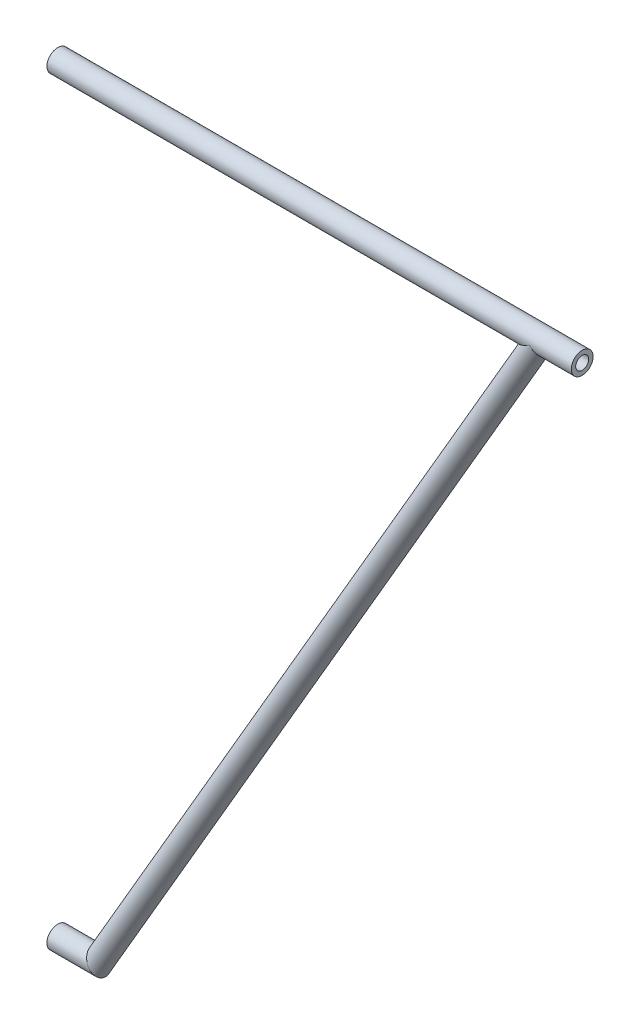
ISO-10303-21;
HEADER;
FILE_DESCRIPTION(('STEP AP214'),'2;1');
FILE_NAME('part.step','',(''),(''),'','','');
FILE_SCHEMA(('AUTOMOTIVE_DESIGN { 1 0 10303 214 1 1 1 1 }'));
ENDSEC;
DATA;
#1=APPLICATION_CONTEXT('core data for automotive mechanical design processes');
#2=APPLICATION_PROTOCOL_DEFINITION('international standard','automotive_design',2000,#1);
#3=PRODUCT_CONTEXT('',#1,'mechanical');
#4=PRODUCT('Part','Part','',(#3));
#5=PRODUCT_RELATED_PRODUCT_CATEGORY('part','',(#4));
#6=PRODUCT_DEFINITION_FORMATION('','',#4);
#7=PRODUCT_DEFINITION_CONTEXT('part definition',#1,'design');
#8=PRODUCT_DEFINITION('design','',#6,#7);
#9=PRODUCT_DEFINITION_SHAPE('','',#8);
#10=(LENGTH_UNIT() NAMED_UNIT(*) SI_UNIT(.MILLI.,.METRE.));
#11=(NAMED_UNIT(*) PLANE_ANGLE_UNIT() SI_UNIT($,.RADIAN.));
#12=(NAMED_UNIT(*) SI_UNIT($,.STERADIAN.) SOLID_ANGLE_UNIT());
#13=UNCERTAINTY_MEASURE_WITH_UNIT(LENGTH_MEASURE(1.E-05),#10,'distance_accuracy_value','');
#14=(GEOMETRIC_REPRESENTATION_CONTEXT(3) GLOBAL_UNCERTAINTY_ASSIGNED_CONTEXT((#13)) GLOBAL_UNIT_ASSIGNED_CONTEXT((#10,
#11,#12)) REPRESENTATION_CONTEXT('',''));
#15=CARTESIAN_POINT('',(0.,0.,0.));
#16=DIRECTION('',(0.,0.,1.));
#17=DIRECTION('',(1.,0.,0.));
#18=AXIS2_PLACEMENT_3D('',#15,#16,#17);
#19=CARTESIAN_POINT('',(-502.784300344481,-1414.57190836725,0.));
#20=DIRECTION('',(0.502784300344481,0.86441190836725,0.));
#21=DIRECTION('',(-0.86441190836725,0.502784300344481,0.));
#22=AXIS2_PLACEMENT_3D('',#19,#20,#21);
#23=CYLINDRICAL_SURFACE('',#22,7.89999999999998);
#24=CARTESIAN_POINT('',(327.345807114745,0.,4.7));
#25=CARTESIAN_POINT('',(327.285238653665,-0.10413362850605,4.69999976951445));
#26=CARTESIAN_POINT('',(327.22687811465,-0.209573285243799,4.69653902828784));
#27=CARTESIAN_POINT('',(327.115220690938,-0.422607114112524,4.6821787915491));
#28=CARTESIAN_POINT('',(327.061923464368,-0.530201140186111,4.67127979867354));
#29=CARTESIAN_POINT('',(326.960908461362,-0.74702302383423,4.64154460837723));
#30=CARTESIAN_POINT('',(326.913195071602,-0.856252090926869,4.62270222338164));
#31=CARTESIAN_POINT('',(326.823856307019,-1.07539005260659,4.57668681265745));
#32=CARTESIAN_POINT('',(326.782227947919,-1.1852985862098,4.54951789088959));
#33=CARTESIAN_POINT('',(326.705095489311,-1.4053880351159,4.48642938079778));
#34=CARTESIAN_POINT('',(326.669621271144,-1.5155677819011,4.45046903280596));
#35=CARTESIAN_POINT('',(326.605050912032,-1.73457877759029,4.36976607416312));
#36=CARTESIAN_POINT('',(326.575955001464,-1.84340997765274,4.32502314640809));
#37=CARTESIAN_POINT('',(326.523906224731,-2.05859375961628,4.22684020810985));
#38=CARTESIAN_POINT('',(326.500953658488,-2.16494622027243,4.17339977315359));
#39=CARTESIAN_POINT('',(326.460737567785,-2.37408152119991,4.05807805055075));
#40=CARTESIAN_POINT('',(326.443473935926,-2.47686442882702,3.99619692228472));
#41=CARTESIAN_POINT('',(326.414854837532,-2.67213216538377,3.86814548257));
#42=CARTESIAN_POINT('',(326.403218026436,-2.76486979913981,3.80242263469956));
#43=CARTESIAN_POINT('',(326.383839770197,-2.94560165394945,3.66420416694769));
#44=CARTESIAN_POINT('',(326.376099659844,-3.03359424041392,3.59170623637296));
#45=CARTESIAN_POINT('',(326.35777215524,-3.28945388700425,3.36472687832804));
#46=CARTESIAN_POINT('',(326.352061502246,-3.44932516235784,3.2006797075376));
#47=CARTESIAN_POINT('',(326.348526590962,-3.75486332749254,2.83753030463128));
#48=CARTESIAN_POINT('',(326.351344582087,-3.89848355775103,2.63670019952504));
#49=CARTESIAN_POINT('',(326.358546755256,-4.08895300396531,2.32070250619039));
#50=CARTESIAN_POINT('',(326.361445933165,-4.14831029698243,2.21284321713339));
#51=CARTESIAN_POINT('',(326.367708734194,-4.25837636626431,1.99282193333962));
#52=CARTESIAN_POINT('',(326.371072220233,-4.30908768532305,1.88066121558784));
#53=CARTESIAN_POINT('',(326.378018740262,-4.40462844720377,1.64513212168538));
#54=CARTESIAN_POINT('',(326.381601508272,-4.44884294493837,1.5215143046056));
#55=CARTESIAN_POINT('',(326.388307913216,-4.52678306386795,1.27100028801385));
#56=CARTESIAN_POINT('',(326.391431542757,-4.56050851616869,1.14410403574826));
#57=CARTESIAN_POINT('',(326.39687477889,-4.6172320215262,0.887909404895051));
#58=CARTESIAN_POINT('',(326.399194330752,-4.64022934439821,0.758610863423909));
#59=CARTESIAN_POINT('',(326.402795156322,-4.67532726386262,0.498530766742787));
#60=CARTESIAN_POINT('',(326.404076447466,-4.68742804345031,0.367749236475301));
#61=CARTESIAN_POINT('',(326.405481699087,-4.70068006564592,0.10493100695073));
#62=CARTESIAN_POINT('',(326.405599494203,-4.70177297820447,-0.0271086715488298));
#63=CARTESIAN_POINT('',(326.40465062759,-4.69285100038206,-0.290759702374713));
#64=CARTESIAN_POINT('',(326.403584394417,-4.68284012898141,-0.422371192395148));
#65=CARTESIAN_POINT('',(326.400370115811,-4.65178538832378,-0.684320478320359));
#66=CARTESIAN_POINT('',(326.398221679788,-4.63073753546507,-0.814657797022265));
#67=CARTESIAN_POINT('',(326.393059994494,-4.57776999130954,-1.0730363337992));
#68=CARTESIAN_POINT('',(326.390047062585,-4.54585428885853,-1.20107837618903));
#69=CARTESIAN_POINT('',(326.38349202896,-4.47145442253888,-1.45375564398966));
#70=CARTESIAN_POINT('',(326.379951018685,-4.4289919391968,-1.57839728322401));
#71=CARTESIAN_POINT('',(326.372775939509,-4.33378130681912,-1.82363226414578));
#72=CARTESIAN_POINT('',(326.369141905397,-4.28103695543319,-1.94422708132511));
#73=CARTESIAN_POINT('',(326.362327376043,-4.16557865180082,-2.18065895238851));
#74=CARTESIAN_POINT('',(326.359147181816,-4.10285814050569,-2.29649281258089));
#75=CARTESIAN_POINT('',(326.353905718178,-3.96793132682003,-2.52246530893198));
#76=CARTESIAN_POINT('',(326.351844015463,-3.89572871127159,-2.63260613558463));
#77=CARTESIAN_POINT('',(326.349599352749,-3.74195436957181,-2.84697391686338));
#78=CARTESIAN_POINT('',(326.349425506617,-3.6603391141074,-2.95116976946934));
#79=CARTESIAN_POINT('',(326.35185665058,-3.48866473393479,-3.15225090956117));
#80=CARTESIAN_POINT('',(326.3544604228,-3.39860932568108,-3.24913938110496));
#81=CARTESIAN_POINT('',(326.363398056002,-3.21076249930477,-3.43488665722103));
#82=CARTESIAN_POINT('',(326.369731155657,-3.11297266365844,-3.52374709641207));
#83=CARTESIAN_POINT('',(326.38712092128,-2.91050812602607,-3.69273952637561));
#84=CARTESIAN_POINT('',(326.398177268312,-2.80583388931284,-3.77287210603832));
#85=CARTESIAN_POINT('',(326.425330790969,-2.59569980691065,-3.92020737121361));
#86=CARTESIAN_POINT('',(326.441166451922,-2.49050841132238,-3.98784090172771));
#87=CARTESIAN_POINT('',(326.478761761592,-2.27586731649474,-4.11411333299787));
#88=CARTESIAN_POINT('',(326.500521122752,-2.16641782417984,-4.17275267014877));
#89=CARTESIAN_POINT('',(326.550528114336,-1.94453870822814,-4.28065116497164));
#90=CARTESIAN_POINT('',(326.578770143103,-1.83211173119755,-4.32991835426571));
#91=CARTESIAN_POINT('',(326.642095969467,-1.60545288234261,-4.41897583461929));
#92=CARTESIAN_POINT('',(326.67717937275,-1.4912211148888,-4.4587666715702));
#93=CARTESIAN_POINT('',(326.750822124253,-1.27238932754458,-4.52580735324716));
#94=CARTESIAN_POINT('',(326.788795082312,-1.16783596074914,-4.55385767713221));
#95=CARTESIAN_POINT('',(326.870304329732,-0.95911906674372,-4.6023458114175));
#96=CARTESIAN_POINT('',(326.913842692437,-0.854955699786452,-4.62278077361646));
#97=CARTESIAN_POINT('',(327.052380084069,-0.544202498586157,-4.6730939423617));
#98=CARTESIAN_POINT('',(327.155334817728,-0.339250227044663,-4.69200991926504));
#99=CARTESIAN_POINT('',(327.344324907706,0.000526382533244408,-4.70207883516496));
#100=CARTESIAN_POINT('',(327.425991875369,0.137732065188808,-4.69992260692562));
#101=CARTESIAN_POINT('',(327.596139926183,0.407262435804782,-4.68426520974023));
#102=CARTESIAN_POINT('',(327.684623545685,0.539585279601888,-4.67075979927266));
#103=CARTESIAN_POINT('',(327.867169844283,0.799293615146722,-4.63340075123567));
#104=CARTESIAN_POINT('',(327.961246896142,0.926664861970003,-4.60951936384658));
#105=CARTESIAN_POINT('',(328.153447653544,1.17607384466345,-4.55227576220704));
#106=CARTESIAN_POINT('',(328.251571377682,1.29811155601988,-4.51891350438635));
#107=CARTESIAN_POINT('',(328.488859711038,1.58273462449444,-4.42888190808528));
#108=CARTESIAN_POINT('',(328.629348964984,1.74294760756097,-4.36817985657278));
#109=CARTESIAN_POINT('',(328.913190063648,2.05383099523372,-4.23091731963089));
#110=CARTESIAN_POINT('',(329.056543242698,2.20449680858384,-4.15434927866223));
#111=CARTESIAN_POINT('',(329.343621753431,2.49646516544909,-3.98573404520773));
#112=CARTESIAN_POINT('',(329.487347025201,2.63776912941422,-3.89368920850983));
#113=CARTESIAN_POINT('',(329.772762505614,2.91093775610667,-3.69392253049755));
#114=CARTESIAN_POINT('',(329.914453668499,3.04280696878808,-3.58620832287862));
#115=CARTESIAN_POINT('',(330.150859133933,3.25804569860989,-3.38960693915649));
#116=CARTESIAN_POINT('',(330.246766804358,3.34397790389021,-3.30494260096134));
#117=CARTESIAN_POINT('',(330.435313792785,3.51066642574493,-3.12730825805008));
#118=CARTESIAN_POINT('',(330.527953911371,3.59142401417176,-3.03434030780459));
#119=CARTESIAN_POINT('',(330.708618309027,3.74710651559006,-2.83983790904415));
#120=CARTESIAN_POINT('',(330.796650665829,3.82204175553489,-2.7383193257201));
#121=CARTESIAN_POINT('',(330.96677267741,3.96543576207824,-2.52620286686403));
#122=CARTESIAN_POINT('',(331.048864632756,4.03389703906234,-2.41560854192999));
#123=CARTESIAN_POINT('',(331.235527152156,4.18828694415504,-2.14051776511782));
#124=CARTESIAN_POINT('',(331.336605147753,4.27081121681039,-1.97164554724895));
#125=CARTESIAN_POINT('',(331.518009014326,4.41771290468907,-1.61576981204672));
#126=CARTESIAN_POINT('',(331.598363803511,4.48211561921144,-1.42879206710113));
#127=CARTESIAN_POINT('',(331.719126452987,4.57841694268126,-1.07483185126058));
#128=CARTESIAN_POINT('',(331.764161403617,4.61411363818006,-0.910488125784863));
#129=CARTESIAN_POINT('',(331.832098115103,4.66785016058079,-0.574486008227565));
#130=CARTESIAN_POINT('',(331.855019361196,4.68590553211215,-0.40283419511419));
#131=CARTESIAN_POINT('',(331.876551818397,4.70286914976343,-0.0564154279541589));
#132=CARTESIAN_POINT('',(331.875077227393,4.70170981620163,0.118360360406875));
#133=CARTESIAN_POINT('',(331.847760499268,4.68018385323926,0.464795883808734));
#134=CARTESIAN_POINT('',(331.82190893678,4.65980979445592,0.636454387381703));
#135=CARTESIAN_POINT('',(331.750054318458,4.60292965646036,0.964081063873849));
#136=CARTESIAN_POINT('',(331.705030151655,4.5672065385887,1.12040777261819));
#137=CARTESIAN_POINT('',(331.598382899072,4.48209174898499,1.4232511156704));
#138=CARTESIAN_POINT('',(331.536753016663,4.43269448026953,1.56976370238431));
#139=CARTESIAN_POINT('',(331.359739031156,4.28974020399538,1.93554657630225));
#140=CARTESIAN_POINT('',(331.234144512817,4.18736231056676,2.14647383146282));
#141=CARTESIAN_POINT('',(331.029358653828,4.01761372322883,2.441670655447));
#142=CARTESIAN_POINT('',(330.958223723316,3.95821424963641,2.53668665724759));
#143=CARTESIAN_POINT('',(330.811528420478,3.83459707091441,2.71993694851813));
#144=CARTESIAN_POINT('',(330.735969029551,3.77038043340924,2.8081727319585));
#145=CARTESIAN_POINT('',(330.541747878189,3.60360318914047,3.0217026431959));
#146=CARTESIAN_POINT('',(330.420853403479,3.49826708319141,3.14279623707265));
#147=CARTESIAN_POINT('',(330.173803761099,3.27892381579384,3.37101090792349));
#148=CARTESIAN_POINT('',(330.047645797082,3.16491201799454,3.47812442964781));
#149=CARTESIAN_POINT('',(329.791919575088,2.92859399655902,3.67933214559985));
#150=CARTESIAN_POINT('',(329.662342908455,2.80626586944215,3.77338980467209));
#151=CARTESIAN_POINT('',(329.402034213878,2.55390660442084,3.94856273675801));
#152=CARTESIAN_POINT('',(329.271302429143,2.42387705665077,4.02968066878799));
#153=CARTESIAN_POINT('',(329.005168170457,2.15067152936775,4.18211230766783));
#154=CARTESIAN_POINT('',(328.869790018835,2.00717682369002,4.25289851855651));
#155=CARTESIAN_POINT('',(328.601685231864,1.71149991931627,4.38026100070593));
#156=CARTESIAN_POINT('',(328.468959676666,1.55931427515142,4.43683158759726));
#157=CARTESIAN_POINT('',(328.209249901223,1.24685622780002,4.53453440939799));
#158=CARTESIAN_POINT('',(328.082237847916,1.08663352430934,4.57575078227566));
#159=CARTESIAN_POINT('',(327.835918109076,0.75725151950632,4.64162889154813));
#160=CARTESIAN_POINT('',(327.716601053702,0.588103560737033,4.66631111841002));
#161=CARTESIAN_POINT('',(327.558105897321,0.346881207525483,4.68767541987602));
#162=CARTESIAN_POINT('',(327.514377587912,0.278426095603166,4.69225535536163));
#163=CARTESIAN_POINT('',(327.428697762009,0.140180396743926,4.69841920053788));
#164=CARTESIAN_POINT('',(327.386748037402,0.0703885612188404,4.70000015579546));
#165=CARTESIAN_POINT('',(327.345807114745,0.,4.7));
#166=B_SPLINE_CURVE_WITH_KNOTS('',3,(#24,#25,#26,#27,#28,#29,#30,#31,#32,#33,#34,#35,#36,#37,
#38,#39,#40,#41,#42,#43,#44,#45,#46,#47,#48,#49,#50,#51,#52,#53,#54,#55,#56,#57,#58,#59,#60,#61,
#62,#63,#64,#65,#66,#67,#68,#69,#70,#71,#72,#73,#74,#75,#76,#77,#78,#79,#80,#81,#82,#83,#84,#85,
#86,#87,#88,#89,#90,#91,#92,#93,#94,#95,#96,#97,#98,#99,#100,#101,#102,#103,#104,#105,#106,#107,
#108,#109,#110,#111,#112,#113,#114,#115,#116,#117,#118,#119,#120,#121,#122,#123,#124,#125,#126,
#127,#128,#129,#130,#131,#132,#133,#134,#135,#136,#137,#138,#139,#140,#141,#142,#143,#144,#145,
#146,#147,#148,#149,#150,#151,#152,#153,#154,#155,#156,#157,#158,#159,#160,#161,#162,#163,#164,
#165),.UNSPECIFIED.,.T.,.F.,(4,2,2,2,2,2,2,2,2,2,2,2,2,2,2,2,2,2,2,2,2,2,2,2,2,2,2,2,2,2,2,2,2,
2,2,2,2,2,2,2,2,2,2,2,2,2,2,2,2,2,2,2,2,2,2,2,2,2,2,2,2,2,2,2,2,2,2,2,2,2,4),(0.,
0.361343942056019,0.722663468871959,1.08426497027574,1.44568853236527,1.80882064336565,
2.17196586803396,2.53512881844926,2.89828491242532,3.24067943177419,3.58319115654013,
4.26777815390921,5.00516726090629,5.37429744947756,5.74331888833057,6.13686687087746,
6.53042118999238,6.92400229154453,7.31757678321766,7.71323571302733,8.10875148202735,
8.50441010375319,8.8999236624515,9.29463081545377,9.68919245705355,10.084014592536,
10.4786836648652,10.8752572100843,11.2716569451399,11.6679757849418,12.0642678675468,
12.4419229953138,12.819559793598,13.1968714971389,13.5741614601353,13.9179061836666,
14.2617793415321,14.9492027979007,15.4276914469865,15.9063590008534,16.3863146742481,
16.8662725533603,17.5300591286976,18.1941625351485,18.8581649469939,19.5218449513956,
19.9838837728566,20.4458085921847,20.9068944608383,21.3678007963432,22.0059153936466,
22.6431346556333,23.163268164386,23.682942943746,24.2044458482624,24.7261504748316,
25.2239211081952,25.7218957866939,26.5150083745243,26.9129770932223,27.3108578695328,
27.9127810844067,28.5150282614091,29.118928164252,29.7227038099107,30.3508353603949,
30.9792176821702,31.6041040964964,32.2282146606482,32.4722228787274,32.7164713559135),.UNSPECIFIED.);
#167=CARTESIAN_POINT('',(327.345807114745,0.,4.7));
#168=VERTEX_POINT('',#167);
#169=EDGE_CURVE('E50',#168,#168,#166,.T.);
#170=ORIENTED_EDGE('',*,*,#169,.T.);
#171=EDGE_LOOP('',(#170));
#172=FACE_BOUND('',#171,.T.);
#173=ADVANCED_FACE('F39',(#172),#23,.T.);
#174=CARTESIAN_POINT('',(-502.784300344481,-1414.57190836725,0.));
#175=DIRECTION('',(0.502784300344481,0.86441190836725,0.));
#176=DIRECTION('',(-0.86441190836725,0.502784300344481,0.));
#177=AXIS2_PLACEMENT_3D('',#174,#175,#176);
#178=CYLINDRICAL_SURFACE('',#177,7.89999999999998);
#179=CARTESIAN_POINT('',(308.127088356517,-4.70000000000022,0.));
#180=CARTESIAN_POINT('',(308.127090064675,-4.69999878472702,0.0989611156167974));
#181=CARTESIAN_POINT('',(308.131071673241,-4.69686443081223,0.197969839318741));
#182=CARTESIAN_POINT('',(308.14687284125,-4.68441283159583,0.395020000757673));
#183=CARTESIAN_POINT('',(308.158699162925,-4.67509025196863,0.493060529836296));
#184=CARTESIAN_POINT('',(308.189857946613,-4.65048546529992,0.687463755996175));
#185=CARTESIAN_POINT('',(308.209211200251,-4.63518674987498,0.783821026241028));
#186=CARTESIAN_POINT('',(308.254847492438,-4.59902436466502,0.973832271124095));
#187=CARTESIAN_POINT('',(308.281134452168,-4.57815754590312,1.06748468274285));
#188=CARTESIAN_POINT('',(308.368667520336,-4.50846269683752,1.34121479531705));
#189=CARTESIAN_POINT('',(308.439016913775,-4.45220341669055,1.51657107319673));
#190=CARTESIAN_POINT('',(308.598421921588,-4.32357886608922,1.85175867452132));
#191=CARTESIAN_POINT('',(308.687474805981,-4.25121594604833,2.01159225870229));
#192=CARTESIAN_POINT('',(308.859939545387,-4.10949548107154,2.28488426102534));
#193=CARTESIAN_POINT('',(308.940852315444,-4.04248774799532,2.4011856956856));
#194=CARTESIAN_POINT('',(309.109485281998,-3.90139010908576,2.62423016797008));
#195=CARTESIAN_POINT('',(309.197209083651,-3.82729644771512,2.73096807823893));
#196=CARTESIAN_POINT('',(309.3780260343,-3.67274447321952,2.93554640034488));
#197=CARTESIAN_POINT('',(309.471134348672,-3.59226792016089,3.03335946038532));
#198=CARTESIAN_POINT('',(309.661108495244,-3.42579850149408,3.22017903411196));
#199=CARTESIAN_POINT('',(309.757974090436,-3.33980598360579,3.30918610201993));
#200=CARTESIAN_POINT('',(309.995033161913,-3.12602750869938,3.51397987748186));
#201=CARTESIAN_POINT('',(310.136550008226,-2.99568740986427,3.62558264009068));
#202=CARTESIAN_POINT('',(310.422160304814,-2.72543496576536,3.83288628906537));
#203=CARTESIAN_POINT('',(310.566255015166,-2.58551783921238,3.92857914952385));
#204=CARTESIAN_POINT('',(310.854497791709,-2.29633333796681,4.10432375579022));
#205=CARTESIAN_POINT('',(310.998645829672,-2.14706873021156,4.18438010151391));
#206=CARTESIAN_POINT('',(311.284568537391,-1.83899093853012,4.3286292560458));
#207=CARTESIAN_POINT('',(311.426344306624,-1.68018234400841,4.39282961480296));
#208=CARTESIAN_POINT('',(311.664648803219,-1.39994065193017,4.48835024004018));
#209=CARTESIAN_POINT('',(311.762417539049,-1.28096267036062,4.52381133489818));
#210=CARTESIAN_POINT('',(311.954333426002,-1.03785857010876,4.58569293563082));
#211=CARTESIAN_POINT('',(312.048481514042,-0.913733800776683,4.61211579449569));
#212=CARTESIAN_POINT('',(312.231770202434,-0.660552438125307,4.65511803811332));
#213=CARTESIAN_POINT('',(312.320920485941,-0.531506257457223,4.67171709828596));
#214=CARTESIAN_POINT('',(312.493053778521,-0.268449670130713,4.69418224565891));
#215=CARTESIAN_POINT('',(312.576038472059,-0.13444063444815,4.7000512747685));
#216=CARTESIAN_POINT('',(312.716764407752,0.107634210986176,4.69995955644124));
#217=CARTESIAN_POINT('',(312.776010491079,0.214827832182839,4.69634318708091));
#218=CARTESIAN_POINT('',(312.889254407507,0.431419015787148,4.68141587442133));
#219=CARTESIAN_POINT('',(312.943253571151,0.54081601091177,4.6701068877069));
#220=CARTESIAN_POINT('',(313.045408485386,0.761138284943872,4.6392923955619));
#221=CARTESIAN_POINT('',(313.093566401293,0.872062980457509,4.61978993944275));
#222=CARTESIAN_POINT('',(313.183592785849,1.09456764466282,4.57218286251103));
#223=CARTESIAN_POINT('',(313.225464179868,1.2061472833085,4.54408226136725));
#224=CARTESIAN_POINT('',(313.302903185831,1.42956470832868,4.47883426500519));
#225=CARTESIAN_POINT('',(313.338436493702,1.54140076708906,4.44164007708693));
#226=CARTESIAN_POINT('',(313.402934072149,1.76358224609042,4.35819442607302));
#227=CARTESIAN_POINT('',(313.431898246255,1.87392764441832,4.31194282998569));
#228=CARTESIAN_POINT('',(313.483537066108,2.09198797312092,4.21046958182852));
#229=CARTESIAN_POINT('',(313.506209078723,2.19970178509075,4.15524418970388));
#230=CARTESIAN_POINT('',(313.545747355482,2.41132237133537,4.03612054572615));
#231=CARTESIAN_POINT('',(313.562613740438,2.51522922479067,3.97222247438537));
#232=CARTESIAN_POINT('',(313.59019342262,2.71099809879924,3.84101140387617));
#233=CARTESIAN_POINT('',(313.601259131656,2.80319109724101,3.77426485845722));
#234=CARTESIAN_POINT('',(313.619576561159,2.98273277783792,3.63404702231191));
#235=CARTESIAN_POINT('',(313.626827002491,3.07007982653732,3.56057348592784));
#236=CARTESIAN_POINT('',(313.643812387862,3.32384717947981,3.33077031052559));
#237=CARTESIAN_POINT('',(313.64879989124,3.48214081852818,3.16495952648943));
#238=CARTESIAN_POINT('',(313.651172604241,3.78451415607224,2.79793066264897));
#239=CARTESIAN_POINT('',(313.647919281043,3.92645104874832,2.59494285412697));
#240=CARTESIAN_POINT('',(313.640288661153,4.11407948147611,2.27588329569043));
#241=CARTESIAN_POINT('',(313.637284028924,4.17243712865346,2.16703016032428));
#242=CARTESIAN_POINT('',(313.630878405063,4.28040125317135,1.94508891661928));
#243=CARTESIAN_POINT('',(313.627477531783,4.33001033250527,1.83200207963705));
#244=CARTESIAN_POINT('',(313.620524276421,4.42306358999647,1.59491491036445));
#245=CARTESIAN_POINT('',(313.616976146282,4.4659091990946,1.4706795508755));
#246=CARTESIAN_POINT('',(313.610393630257,4.54105427477568,1.21904329364231));
#247=CARTESIAN_POINT('',(313.607359252061,4.57335358349369,1.09164234854391));
#248=CARTESIAN_POINT('',(313.602134967185,4.62717622344869,0.834558905670712));
#249=CARTESIAN_POINT('',(313.599945108458,4.64869894278929,0.704876278774325));
#250=CARTESIAN_POINT('',(313.596629364999,4.68080975123193,0.444152671336698));
#251=CARTESIAN_POINT('',(313.595503462179,4.69139802622533,0.313111713926052));
#252=CARTESIAN_POINT('',(313.59442101888,4.70158361813661,0.0500633312163522));
#253=CARTESIAN_POINT('',(313.594469259033,4.70113600131227,-0.0819458566984744));
#254=CARTESIAN_POINT('',(313.595742095373,4.68914466661991,-0.345405263157774));
#255=CARTESIAN_POINT('',(313.596966265438,4.67760496818585,-0.476855666858163));
#256=CARTESIAN_POINT('',(313.600472822755,4.6435142326696,-0.738354951048037));
#257=CARTESIAN_POINT('',(313.602755596773,4.62095917091041,-0.868403301506009));
#258=CARTESIAN_POINT('',(313.608146762893,4.56501053348041,-1.12607923594611));
#259=CARTESIAN_POINT('',(313.611254852483,4.53162092811717,-1.25370768859159));
#260=CARTESIAN_POINT('',(313.617947157523,4.4543011728361,-1.50549582665339));
#261=CARTESIAN_POINT('',(313.621530611002,4.41038780267358,-1.62966068629994));
#262=CARTESIAN_POINT('',(313.62872110102,4.31231827321399,-1.87382311071715));
#263=CARTESIAN_POINT('',(313.632328128359,4.2581659036289,-1.99382219795669));
#264=CARTESIAN_POINT('',(313.639003535618,4.13994179690266,-2.22894787131509));
#265=CARTESIAN_POINT('',(313.642071553406,4.07586344500685,-2.34407114252399));
#266=CARTESIAN_POINT('',(313.646988015,3.93828321451236,-2.56850998378759));
#267=CARTESIAN_POINT('',(313.648836934575,3.86478502552149,-2.67782780416384));
#268=CARTESIAN_POINT('',(313.650538977422,3.70852676945062,-2.89038095359925));
#269=CARTESIAN_POINT('',(313.650383462057,3.62572813865743,-2.99358802801296));
#270=CARTESIAN_POINT('',(313.647167852405,3.45178465353319,-3.19259113857089));
#271=CARTESIAN_POINT('',(313.644109043302,3.36064350826132,-3.28839043358039));
#272=CARTESIAN_POINT('',(313.63412853184,3.17074475239055,-3.47185862923065));
#273=CARTESIAN_POINT('',(313.627207823926,3.07198910817656,-3.55952961614879));
#274=CARTESIAN_POINT('',(313.608509867252,2.86772964055623,-3.7260548618861));
#275=CARTESIAN_POINT('',(313.596732966598,2.76222630130172,-3.8049097521532));
#276=CARTESIAN_POINT('',(313.568093675772,2.55093411091714,-3.94946766468979));
#277=CARTESIAN_POINT('',(313.551513962977,2.44542149790822,-4.01563026675264));
#278=CARTESIAN_POINT('',(313.512376395226,2.23032450567403,-4.13896348832268));
#279=CARTESIAN_POINT('',(313.489818844831,2.12074033413233,-4.19613456569661));
#280=CARTESIAN_POINT('',(313.43819557824,1.89877597831275,-4.30112903050296));
#281=CARTESIAN_POINT('',(313.409135159355,1.78639813565405,-4.34895996746215));
#282=CARTESIAN_POINT('',(313.34419227375,1.56001819445883,-4.43520178800122));
#283=CARTESIAN_POINT('',(313.308310160707,1.44601618041199,-4.47361315970911));
#284=CARTESIAN_POINT('',(313.233134124479,1.2275939434359,-4.53815229818352));
#285=CARTESIAN_POINT('',(313.194411608884,1.12320616704817,-4.56505973050166));
#286=CARTESIAN_POINT('',(313.111456323043,0.914933404518162,-4.61132229614015));
#287=CARTESIAN_POINT('',(313.067221502774,0.811048620449186,-4.6306746085898));
#288=CARTESIAN_POINT('',(312.926706032806,0.50126546558186,-4.67785201202526));
#289=CARTESIAN_POINT('',(312.822581492066,0.297142800024066,-4.69482487531678));
#290=CARTESIAN_POINT('',(312.630944383821,-0.0428048397114051,-4.70191478997661));
#291=CARTESIAN_POINT('',(312.547610153642,-0.180993569947768,-4.6984837838204));
#292=CARTESIAN_POINT('',(312.374144415078,-0.452332702314289,-4.68015672627542));
#293=CARTESIAN_POINT('',(312.28401028116,-0.585481128207589,-4.66525622571353));
#294=CARTESIAN_POINT('',(312.098203825379,-0.846723787812234,-4.62499615491089));
#295=CARTESIAN_POINT('',(312.002516843528,-0.974802987364414,-4.59960770514081));
#296=CARTESIAN_POINT('',(311.807172881216,-1.22551884866798,-4.53924254082344));
#297=CARTESIAN_POINT('',(311.70751591155,-1.34815552521767,-4.50426585234857));
#298=CARTESIAN_POINT('',(311.467680116284,-1.63291476374817,-4.41063497854179));
#299=CARTESIAN_POINT('',(311.326257904598,-1.79269387802106,-4.34801579445619));
#300=CARTESIAN_POINT('',(311.040797017702,-2.10267787781561,-4.20687046357441));
#301=CARTESIAN_POINT('',(310.896757133626,-2.25287818754179,-4.12833678815645));
#302=CARTESIAN_POINT('',(310.6085930242,-2.54382915706897,-3.95569677523324));
#303=CARTESIAN_POINT('',(310.464468847753,-2.68458319297179,-3.8615960435136));
#304=CARTESIAN_POINT('',(310.178550896258,-2.95655293418377,-3.65755172728354));
#305=CARTESIAN_POINT('',(310.036755967044,-3.08777348097364,-3.54761627007965));
#306=CARTESIAN_POINT('',(309.802736892805,-3.2997303228641,-3.34896797733091));
#307=CARTESIAN_POINT('',(309.709168654074,-3.38318560605854,-3.26471980977879));
#308=CARTESIAN_POINT('',(309.525332115897,-3.54505831673641,-3.08818788238008));
#309=CARTESIAN_POINT('',(309.435062995192,-3.6234770017283,-2.99590614196871));
#310=CARTESIAN_POINT('',(309.25912641926,-3.77462808319676,-2.80306283649738));
#311=CARTESIAN_POINT('',(309.173450939311,-3.84737050412696,-2.70251654299131));
#312=CARTESIAN_POINT('',(309.007979616201,-3.98653789050054,-2.49266192031868));
#313=CARTESIAN_POINT('',(308.928181603608,-4.05296518957856,-2.38335685552463));
#314=CARTESIAN_POINT('',(308.745315856775,-4.20398406938329,-2.10947728789548));
#315=CARTESIAN_POINT('',(308.645889296136,-4.28505665891308,-1.94042857507344));
#316=CARTESIAN_POINT('',(308.467902403987,-4.42903886456287,-1.58441743320801));
#317=CARTESIAN_POINT('',(308.389322521666,-4.49196550350207,-1.39747201395043));
#318=CARTESIAN_POINT('',(308.271629739621,-4.58575833677188,-1.04307790692038));
#319=CARTESIAN_POINT('',(308.227957764887,-4.62035743491786,-0.878181146877133));
#320=CARTESIAN_POINT('',(308.179184939522,-4.65891874914237,-0.625888496755716));
#321=CARTESIAN_POINT('',(308.165720979773,-4.66954616737323,-0.541042325380013));
#322=CARTESIAN_POINT('',(308.14463071638,-4.68618168801877,-0.370196567879828));
#323=CARTESIAN_POINT('',(308.137000748362,-4.69219269005029,-0.284197740349041));
#324=CARTESIAN_POINT('',(308.130620782689,-4.6972181049302,-0.165022792104421));
#325=CARTESIAN_POINT('',(308.129296998308,-4.69826068986071,-0.132044053223876));
#326=CARTESIAN_POINT('',(308.127530454211,-4.69965187640064,-0.0660453128833026));
#327=CARTESIAN_POINT('',(308.12708778647,-4.70000040556124,-0.0330253074756204));
#328=CARTESIAN_POINT('',(308.127088356517,-4.70000000000022,0.));
#329=B_SPLINE_CURVE_WITH_KNOTS('',3,(#179,#180,#181,#182,#183,#184,#185,#186,#187,#188,#189,
#190,#191,#192,#193,#194,#195,#196,#197,#198,#199,#200,#201,#202,#203,#204,#205,#206,#207,#208,
#209,#210,#211,#212,#213,#214,#215,#216,#217,#218,#219,#220,#221,#222,#223,#224,#225,#226,#227,
#228,#229,#230,#231,#232,#233,#234,#235,#236,#237,#238,#239,#240,#241,#242,#243,#244,#245,#246,
#247,#248,#249,#250,#251,#252,#253,#254,#255,#256,#257,#258,#259,#260,#261,#262,#263,#264,#265,
#266,#267,#268,#269,#270,#271,#272,#273,#274,#275,#276,#277,#278,#279,#280,#281,#282,#283,#284,
#285,#286,#287,#288,#289,#290,#291,#292,#293,#294,#295,#296,#297,#298,#299,#300,#301,#302,#303,
#304,#305,#306,#307,#308,#309,#310,#311,#312,#313,#314,#315,#316,#317,#318,#319,#320,#321,#322,
#323,#324,#325,#326,#327,#328),.UNSPECIFIED.,.T.,.F.,(4,2,2,2,2,2,2,2,2,2,2,2,2,2,2,2,2,2,2,2,2,
2,2,2,2,2,2,2,2,2,2,2,2,2,2,2,2,2,2,2,2,2,2,2,2,2,2,2,2,2,2,2,2,2,2,2,2,2,2,2,2,2,2,2,2,2,2,2,2,
2,2,2,2,2,4),(0.,0.296837947925536,0.593932106627933,0.891852824141119,1.1899423856986,
1.778538311632,2.36704838508079,2.83658520581569,3.30637227463285,3.77755385702198,
4.24870576581808,4.91506771457066,5.58176480290168,6.24826546736117,6.91444815793591,
7.38819245121647,7.86181331713767,8.33448236135439,8.80702179195781,9.17427730778379,
9.54143944862698,9.90846506594614,10.2753193587431,10.6441026360439,11.0128913286668,
11.38183411933,11.7507692320311,12.0934543462799,12.4362542784422,13.1213259467974,
13.8610752385299,14.2313984492838,14.6016113323066,14.9955419899907,15.3894785440543,
15.7834374633598,16.1773896850441,16.5729461866828,16.9683594046584,17.3639172027422,
17.7593302124575,18.1541168970155,18.5487577460887,18.9436627274875,19.3384135006036,
19.7348661220834,20.1311433300987,20.5273185431762,20.9234653622257,21.2998705998733,
21.67625666399,22.052337228781,22.4283983007119,22.7716257989453,23.1149813264545,
23.8013820739791,24.2850278975946,24.7688614286198,25.2540362153602,25.7392096828222,
26.4054401907919,27.0719866093347,27.7382935211301,28.4042596559202,28.8571367409068,
29.3099003110691,29.7618452860376,30.2136225987293,30.8481132489817,31.4820067290566,
32.0017422796638,32.2611590442187,32.5204127329633,32.6194631660487,32.7185239379446),.UNSPECIFIED.);
#330=CARTESIAN_POINT('',(308.127088356517,-4.70000000000022,0.));
#331=VERTEX_POINT('',#330);
#332=EDGE_CURVE('E65',#331,#331,#329,.T.);
#333=ORIENTED_EDGE('',*,*,#332,.T.);
#334=EDGE_LOOP('',(#333));
#335=FACE_BOUND('',#334,.T.);
#336=ADVANCED_FACE('F89',(#335),#178,.T.);
#337=CARTESIAN_POINT('',(350.,0.,0.));
#338=DIRECTION('',(-1.,0.,0.));
#339=DIRECTION('',(0.,0.,1.));
#340=AXIS2_PLACEMENT_3D('',#337,#338,#339);
#341=CYLINDRICAL_SURFACE('',#340,4.7);
#342=CARTESIAN_POINT('',(350.,0.,0.));
#343=DIRECTION('',(1.,0.,0.));
#344=DIRECTION('',(0.,0.,-1.));
#345=AXIS2_PLACEMENT_3D('',#342,#343,#344);
#346=CIRCLE('',#345,4.7);
#347=CARTESIAN_POINT('',(350.,0.,-4.7));
#348=VERTEX_POINT('',#347);
#349=EDGE_CURVE('E69',#348,#348,#346,.T.);
#350=ORIENTED_EDGE('',*,*,#349,.T.);
#351=EDGE_LOOP('',(#350));
#352=FACE_BOUND('',#351,.T.);
#353=ORIENTED_EDGE('',*,*,#169,.F.);
#354=EDGE_LOOP('',(#353));
#355=FACE_BOUND('',#354,.T.);
#356=ADVANCED_FACE('F84',(#352,#355),#341,.F.);
#357=CARTESIAN_POINT('',(350.,0.,0.));
#358=DIRECTION('',(-1.,0.,0.));
#359=DIRECTION('',(0.,0.,1.));
#360=AXIS2_PLACEMENT_3D('',#357,#358,#359);
#361=CYLINDRICAL_SURFACE('',#360,4.7);
#362=CARTESIAN_POINT('',(-30.,0.,0.));
#363=DIRECTION('',(1.,0.,0.));
#364=DIRECTION('',(0.,0.,-1.));
#365=AXIS2_PLACEMENT_3D('',#362,#363,#364);
#366=CIRCLE('',#365,4.7);
#367=CARTESIAN_POINT('',(-30.,0.,-4.7));
#368=VERTEX_POINT('',#367);
#369=EDGE_CURVE('E72',#368,#368,#366,.T.);
#370=ORIENTED_EDGE('',*,*,#369,.F.);
#371=EDGE_LOOP('',(#370));
#372=FACE_BOUND('',#371,.T.);
#373=ORIENTED_EDGE('',*,*,#332,.F.);
#374=EDGE_LOOP('',(#373));
#375=FACE_BOUND('',#374,.T.);
#376=ADVANCED_FACE('F88',(#372,#375),#361,.F.);
#377=CARTESIAN_POINT('',(350.,0.,0.));
#378=DIRECTION('',(1.,0.,0.));
#379=DIRECTION('',(0.,0.,-1.));
#380=AXIS2_PLACEMENT_3D('',#377,#378,#379);
#381=PLANE('',#380);
#382=CARTESIAN_POINT('',(350.,0.,0.));
#383=DIRECTION('',(1.,0.,0.));
#384=DIRECTION('',(0.,0.,-1.));
#385=AXIS2_PLACEMENT_3D('',#382,#383,#384);
#386=CIRCLE('',#385,7.9);
#387=CARTESIAN_POINT('',(350.,0.,-7.9));
#388=VERTEX_POINT('',#387);
#389=EDGE_CURVE('E62',#388,#388,#386,.T.);
#390=ORIENTED_EDGE('',*,*,#389,.T.);
#391=EDGE_LOOP('',(#390));
#392=FACE_BOUND('',#391,.T.);
#393=ORIENTED_EDGE('',*,*,#349,.F.);
#394=EDGE_LOOP('',(#393));
#395=FACE_BOUND('',#394,.T.);
#396=ADVANCED_FACE('F94',(#392,#395),#381,.T.);
#397=CARTESIAN_POINT('',(-30.,0.,0.));
#398=DIRECTION('',(1.,0.,0.));
#399=DIRECTION('',(0.,0.,-1.));
#400=AXIS2_PLACEMENT_3D('',#397,#398,#399);
#401=PLANE('',#400);
#402=CARTESIAN_POINT('',(-30.,0.,0.));
#403=DIRECTION('',(1.,0.,0.));
#404=DIRECTION('',(0.,0.,-1.));
#405=AXIS2_PLACEMENT_3D('',#402,#403,#404);
#406=CIRCLE('',#405,7.9);
#407=CARTESIAN_POINT('',(-30.,0.,-7.9));
#408=VERTEX_POINT('',#407);
#409=EDGE_CURVE('E66',#408,#408,#406,.T.);
#410=ORIENTED_EDGE('',*,*,#409,.F.);
#411=EDGE_LOOP('',(#410));
#412=FACE_BOUND('',#411,.T.);
#413=ORIENTED_EDGE('',*,*,#369,.T.);
#414=EDGE_LOOP('',(#413));
#415=FACE_BOUND('',#414,.T.);
#416=ADVANCED_FACE('F91',(#412,#415),#401,.F.);
#417=CARTESIAN_POINT('',(350.,0.,0.));
#418=DIRECTION('',(-1.,0.,0.));
#419=DIRECTION('',(0.,0.,1.));
#420=AXIS2_PLACEMENT_3D('',#417,#418,#419);
#421=CYLINDRICAL_SURFACE('',#420,7.9);
#422=CARTESIAN_POINT('',(320.,1.09185332263795E-13,0.));
#423=DIRECTION('',(-0.4986059063306,0.866828789422825,0.));
#424=DIRECTION('',(0.866828789422825,0.4986059063306,0.));
#425=AXIS2_PLACEMENT_3D('',#422,#423,#424);
#426=ELLIPSE('',#425,15.8441765324013,7.89999999999999);
#427=CARTESIAN_POINT('',(320.,1.09185332263795E-13,-7.89999999999999));
#428=VERTEX_POINT('',#427);
#429=CARTESIAN_POINT('',(320.,1.09185332263795E-13,7.89999999999999));
#430=VERTEX_POINT('',#429);
#431=EDGE_CURVE('E61',#428,#430,#426,.T.);
#432=ORIENTED_EDGE('',*,*,#431,.T.);
#433=CARTESIAN_POINT('',(320.,1.09185332263795E-13,0.));
#434=DIRECTION('',(0.866828789422825,0.4986059063306,0.));
#435=DIRECTION('',(-0.4986059063306,0.866828789422825,0.));
#436=AXIS2_PLACEMENT_3D('',#433,#434,#435);
#437=ELLIPSE('',#436,9.11367976744309,7.89999999999999);
#438=EDGE_CURVE('E56',#430,#428,#437,.T.);
#439=ORIENTED_EDGE('',*,*,#438,.T.);
#440=EDGE_LOOP('',(#432,#439));
#441=FACE_BOUND('',#440,.T.);
#442=ORIENTED_EDGE('',*,*,#409,.T.);
#443=EDGE_LOOP('',(#442));
#444=FACE_BOUND('',#443,.T.);
#445=ORIENTED_EDGE('',*,*,#389,.F.);
#446=EDGE_LOOP('',(#445));
#447=FACE_BOUND('',#446,.T.);
#448=ADVANCED_FACE('F59',(#441,#444,#447),#421,.T.);
#449=CARTESIAN_POINT('',(-502.784300344481,-1414.57190836725,0.));
#450=DIRECTION('',(0.502784300344481,0.86441190836725,0.));
#451=DIRECTION('',(-0.86441190836725,0.502784300344481,0.));
#452=AXIS2_PLACEMENT_3D('',#449,#450,#451);
#453=CYLINDRICAL_SURFACE('',#452,7.89999999999998);
#454=CARTESIAN_POINT('',(1.2490009027033E-13,-550.16,0.));
#455=DIRECTION('',(0.866828789422825,0.4986059063306,0.));
#456=DIRECTION('',(-0.4986059063306,0.866828789422825,0.));
#457=AXIS2_PLACEMENT_3D('',#454,#455,#456);
#458=ELLIPSE('',#457,9.11367976744308,7.89999999999998);
#459=CARTESIAN_POINT('',(-4.54413456045269,-542.26,0.));
#460=VERTEX_POINT('',#459);
#461=EDGE_CURVE('E103',#460,#460,#458,.T.);
#462=ORIENTED_EDGE('',*,*,#461,.T.);
#463=EDGE_LOOP('',(#462));
#464=FACE_BOUND('',#463,.T.);
#465=ORIENTED_EDGE('',*,*,#431,.F.);
#466=ORIENTED_EDGE('',*,*,#438,.F.);
#467=EDGE_LOOP('',(#465,#466));
#468=FACE_BOUND('',#467,.T.);
#469=ADVANCED_FACE('F64',(#464,#468),#453,.T.);
#470=CARTESIAN_POINT('',(-30.,-550.16,0.));
#471=DIRECTION('',(-1.,0.,0.));
#472=DIRECTION('',(0.,0.,1.));
#473=AXIS2_PLACEMENT_3D('',#470,#471,#472);
#474=PLANE('',#473);
#475=CARTESIAN_POINT('',(-30.,-550.16,0.));
#476=DIRECTION('',(-1.,0.,0.));
#477=DIRECTION('',(0.,0.,1.));
#478=AXIS2_PLACEMENT_3D('',#475,#476,#477);
#479=CIRCLE('',#478,4.69999999999999);
#480=CARTESIAN_POINT('',(-30.,-550.16,4.69999999999999));
#481=VERTEX_POINT('',#480);
#482=EDGE_CURVE('E109',#481,#481,#479,.T.);
#483=ORIENTED_EDGE('',*,*,#482,.F.);
#484=EDGE_LOOP('',(#483));
#485=FACE_BOUND('',#484,.T.);
#486=CARTESIAN_POINT('',(-30.,-550.16,0.));
#487=DIRECTION('',(-1.,0.,0.));
#488=DIRECTION('',(0.,0.,1.));
#489=AXIS2_PLACEMENT_3D('',#486,#487,#488);
#490=CIRCLE('',#489,7.89999999999999);
#491=CARTESIAN_POINT('',(-30.,-550.16,7.89999999999999));
#492=VERTEX_POINT('',#491);
#493=EDGE_CURVE('E113',#492,#492,#490,.T.);
#494=ORIENTED_EDGE('',*,*,#493,.T.);
#495=EDGE_LOOP('',(#494));
#496=FACE_BOUND('',#495,.T.);
#497=ADVANCED_FACE('F120',(#485,#496),#474,.T.);
#498=CARTESIAN_POINT('',(70.,-550.16,0.));
#499=DIRECTION('',(-1.,0.,0.));
#500=DIRECTION('',(0.,0.,1.));
#501=AXIS2_PLACEMENT_3D('',#498,#499,#500);
#502=CYLINDRICAL_SURFACE('',#501,4.69999999999999);
#503=ORIENTED_EDGE('',*,*,#482,.T.);
#504=EDGE_LOOP('',(#503));
#505=FACE_BOUND('',#504,.T.);
#506=CARTESIAN_POINT('',(-11.872911643483,-554.86,0.));
#507=CARTESIAN_POINT('',(-11.8729099353244,-554.859998784726,-0.0989611156168457));
#508=CARTESIAN_POINT('',(-11.8689283267588,-554.856864430812,-0.197969839318841));
#509=CARTESIAN_POINT('',(-11.8531271587496,-554.844412831596,-0.395020000757816));
#510=CARTESIAN_POINT('',(-11.8413008370745,-554.835090251969,-0.493060529836432));
#511=CARTESIAN_POINT('',(-11.8101420533872,-554.8104854653,-0.687463755996297));
#512=CARTESIAN_POINT('',(-11.7907887997494,-554.795186749875,-0.783821026241144));
#513=CARTESIAN_POINT('',(-11.745152507562,-554.759024364665,-0.973832271124174));
#514=CARTESIAN_POINT('',(-11.7188655478316,-554.738157545903,-1.06748468274289));
#515=CARTESIAN_POINT('',(-11.6313324796642,-554.668462696837,-1.34121479531704));
#516=CARTESIAN_POINT('',(-11.5609830862252,-554.61220341669,-1.51657107319667));
#517=CARTESIAN_POINT('',(-11.4015780784116,-554.483578866089,-1.85175867452129));
#518=CARTESIAN_POINT('',(-11.3125251940194,-554.411215946048,-2.0115922587023));
#519=CARTESIAN_POINT('',(-11.1400604546133,-554.269495481072,-2.28488426102536));
#520=CARTESIAN_POINT('',(-11.0591476845563,-554.202487747995,-2.40118569568559));
#521=CARTESIAN_POINT('',(-10.8905147180022,-554.061390109086,-2.6242301679701));
#522=CARTESIAN_POINT('',(-10.8027909163486,-553.987296447715,-2.730968078239));
#523=CARTESIAN_POINT('',(-10.6219739656998,-553.832744473219,-2.93554640034497));
#524=CARTESIAN_POINT('',(-10.5288656513277,-553.752267920161,-3.03335946038537));
#525=CARTESIAN_POINT('',(-10.3388915047565,-553.585798501494,-3.22017903411198));
#526=CARTESIAN_POINT('',(-10.2420259095639,-553.499805983606,-3.30918610201995));
#527=CARTESIAN_POINT('',(-10.0049668380871,-553.286027508699,-3.51397987748188));
#528=CARTESIAN_POINT('',(-9.86344999177347,-553.155687409864,-3.62558264009071));
#529=CARTESIAN_POINT('',(-9.57783969518619,-552.885434965765,-3.8328862890654));
#530=CARTESIAN_POINT('',(-9.43374498483361,-552.745517839212,-3.92857914952388));
#531=CARTESIAN_POINT('',(-9.1455022082907,-552.456333337967,-4.10432375579028));
#532=CARTESIAN_POINT('',(-9.00135417032794,-552.307068730211,-4.18438010151398));
#533=CARTESIAN_POINT('',(-8.71543146260891,-551.99899093853,-4.32862925604588));
#534=CARTESIAN_POINT('',(-8.57365569337584,-551.840182344008,-4.39282961480303));
#535=CARTESIAN_POINT('',(-8.33535119678058,-551.55994065193,-4.48835024004023));
#536=CARTESIAN_POINT('',(-8.23758246095122,-551.44096267036,-4.52381133489821));
#537=CARTESIAN_POINT('',(-8.04566657399777,-551.197858570109,-4.58569293563084));
#538=CARTESIAN_POINT('',(-7.95151848595756,-551.073733800776,-4.61211579449572));
#539=CARTESIAN_POINT('',(-7.76822979756617,-550.820552438125,-4.65511803811334));
#540=CARTESIAN_POINT('',(-7.67907951405942,-550.691506257457,-4.67171709828597));
#541=CARTESIAN_POINT('',(-7.50694622147867,-550.42844967013,-4.69418224565891));
#542=CARTESIAN_POINT('',(-7.42396152794037,-550.294440634448,-4.7000512747685));
#543=CARTESIAN_POINT('',(-7.28323559224771,-550.052365789014,-4.69995955644123));
#544=CARTESIAN_POINT('',(-7.22398950892151,-549.945172167817,-4.69634318708089));
#545=CARTESIAN_POINT('',(-7.11074559249286,-549.728580984213,-4.68141587442131));
#546=CARTESIAN_POINT('',(-7.05674642884883,-549.619183989088,-4.67010688770688));
#547=CARTESIAN_POINT('',(-6.95459151461415,-549.398861715056,-4.63929239556187));
#548=CARTESIAN_POINT('',(-6.90643359870732,-549.287937019542,-4.61978993944271));
#549=CARTESIAN_POINT('',(-6.81640721415075,-549.065432355337,-4.57218286251098));
#550=CARTESIAN_POINT('',(-6.7745358201324,-548.953852716691,-4.5440822613672));
#551=CARTESIAN_POINT('',(-6.69709681416881,-548.730435291671,-4.47883426500512));
#552=CARTESIAN_POINT('',(-6.66156350629805,-548.618599232911,-4.44164007708685));
#553=CARTESIAN_POINT('',(-6.59706592785134,-548.396417753909,-4.35819442607293));
#554=CARTESIAN_POINT('',(-6.56810175374472,-548.286072355581,-4.31194282998562));
#555=CARTESIAN_POINT('',(-6.51646293389204,-548.068012026879,-4.21046958182846));
#556=CARTESIAN_POINT('',(-6.4937909212771,-547.960298214909,-4.15524418970382));
#557=CARTESIAN_POINT('',(-6.45425264451824,-547.748677628664,-4.03612054572609));
#558=CARTESIAN_POINT('',(-6.43738625956237,-547.644770775209,-3.97222247438531));
#559=CARTESIAN_POINT('',(-6.40980657737984,-547.449001901201,-3.84101140387612));
#560=CARTESIAN_POINT('',(-6.39874086834371,-547.356808902759,-3.77426485845719));
#561=CARTESIAN_POINT('',(-6.38042343884139,-547.177267222162,-3.63404702231191));
#562=CARTESIAN_POINT('',(-6.37317299750839,-547.089920173463,-3.56057348592784));
#563=CARTESIAN_POINT('',(-6.35618761213799,-546.83615282052,-3.33077031052556));
#564=CARTESIAN_POINT('',(-6.35120010875986,-546.677859181472,-3.16495952648931));
#565=CARTESIAN_POINT('',(-6.34882739575896,-546.375485843928,-2.79793066264877));
#566=CARTESIAN_POINT('',(-6.3520807189569,-546.233548951252,-2.59494285412678));
#567=CARTESIAN_POINT('',(-6.35971133884685,-546.045920518524,-2.27588329569027));
#568=CARTESIAN_POINT('',(-6.36271597107593,-545.987562871346,-2.16703016032413));
#569=CARTESIAN_POINT('',(-6.36912159493688,-545.879598746829,-1.94508891661913));
#570=CARTESIAN_POINT('',(-6.37252246821757,-545.829989667495,-1.8320020796369));
#571=CARTESIAN_POINT('',(-6.37947572357887,-545.736936410003,-1.59491491036431));
#572=CARTESIAN_POINT('',(-6.38302385371789,-545.694090800905,-1.47067955087536));
#573=CARTESIAN_POINT('',(-6.38960636974309,-545.618945725224,-1.21904329364216));
#574=CARTESIAN_POINT('',(-6.39264074793871,-545.586646416506,-1.09164234854376));
#575=CARTESIAN_POINT('',(-6.39786503281493,-545.532823776551,-0.834558905670552));
#576=CARTESIAN_POINT('',(-6.40005489154195,-545.511301057211,-0.704876278774166));
#577=CARTESIAN_POINT('',(-6.40337063500125,-545.479190248768,-0.444152671336535));
#578=CARTESIAN_POINT('',(-6.40449653782132,-545.468601973775,-0.313111713925884));
#579=CARTESIAN_POINT('',(-6.40557898111946,-545.458416381863,-0.05006333121618));
#580=CARTESIAN_POINT('',(-6.40553074096665,-545.458863998688,0.0819458566986467));
#581=CARTESIAN_POINT('',(-6.40425790462735,-545.47085533338,0.34540526315795));
#582=CARTESIAN_POINT('',(-6.40303373456231,-545.482395031814,0.476855666858344));
#583=CARTESIAN_POINT('',(-6.39952717724541,-545.51648576733,0.738354951048222));
#584=CARTESIAN_POINT('',(-6.39724440322743,-545.53904082909,0.868403301506195));
#585=CARTESIAN_POINT('',(-6.39185323710724,-545.59498946652,1.1260792359463));
#586=CARTESIAN_POINT('',(-6.38874514751677,-545.628379071883,1.25370768859178));
#587=CARTESIAN_POINT('',(-6.38205284247678,-545.705698827164,1.50549582665359));
#588=CARTESIAN_POINT('',(-6.37846938899788,-545.749612197326,1.62966068630015));
#589=CARTESIAN_POINT('',(-6.37127889897951,-545.847681726786,1.87382311071735));
#590=CARTESIAN_POINT('',(-6.3676718716407,-545.901834096371,1.99382219795688));
#591=CARTESIAN_POINT('',(-6.36099646438222,-546.020058203098,2.22894787131528));
#592=CARTESIAN_POINT('',(-6.35792844659399,-546.084136554993,2.34407114252418));
#593=CARTESIAN_POINT('',(-6.35301198499993,-546.221716785488,2.56850998378778));
#594=CARTESIAN_POINT('',(-6.35116306542481,-546.295214974479,2.67782780416402));
#595=CARTESIAN_POINT('',(-6.34946102257854,-546.451473230549,2.8903809535994));
#596=CARTESIAN_POINT('',(-6.3496165379433,-546.534271861343,2.99358802801308));
#597=CARTESIAN_POINT('',(-6.35283214759472,-546.708215346467,3.19259113857098));
#598=CARTESIAN_POINT('',(-6.35589095669798,-546.799356491739,3.28839043358048));
#599=CARTESIAN_POINT('',(-6.36587146816,-546.989255247609,3.47185862923074));
#600=CARTESIAN_POINT('',(-6.37279217607383,-547.088010891824,3.55952961614885));
#601=CARTESIAN_POINT('',(-6.39149013274755,-547.292270359444,3.72605486188616));
#602=CARTESIAN_POINT('',(-6.40326703340175,-547.397773698698,3.80490975215328));
#603=CARTESIAN_POINT('',(-6.43190632422811,-547.609065889083,3.94946766468987));
#604=CARTESIAN_POINT('',(-6.44848603702303,-547.714578502092,4.0156302667527));
#605=CARTESIAN_POINT('',(-6.48762360477379,-547.929675494326,4.13896348832273));
#606=CARTESIAN_POINT('',(-6.51018115516882,-548.039259665868,4.19613456569665));
#607=CARTESIAN_POINT('',(-6.56180442175968,-548.261224021687,4.301129030503));
#608=CARTESIAN_POINT('',(-6.5908648406454,-548.373601864346,4.34895996746218));
#609=CARTESIAN_POINT('',(-6.65580772624997,-548.599981805541,4.43520178800126));
#610=CARTESIAN_POINT('',(-6.69168983929305,-548.713983819588,4.47361315970915));
#611=CARTESIAN_POINT('',(-6.7668658755215,-548.932406056564,4.53815229818356));
#612=CARTESIAN_POINT('',(-6.80558839111633,-549.036793832952,4.56505973050169));
#613=CARTESIAN_POINT('',(-6.88854367695673,-549.245066595482,4.61132229614017));
#614=CARTESIAN_POINT('',(-6.93277849722638,-549.348951379551,4.63067460858982));
#615=CARTESIAN_POINT('',(-7.07329396719428,-549.658734534418,4.67785201202527));
#616=CARTESIAN_POINT('',(-7.17741850793455,-549.862857199976,4.69482487531678));
#617=CARTESIAN_POINT('',(-7.36905561617904,-550.202804839711,4.7019147899766));
#618=CARTESIAN_POINT('',(-7.45238984635848,-550.340993569948,4.69848378382039));
#619=CARTESIAN_POINT('',(-7.62585558492194,-550.612332702314,4.68015672627539));
#620=CARTESIAN_POINT('',(-7.71598971883986,-550.745481128208,4.66525622571351));
#621=CARTESIAN_POINT('',(-7.90179617462081,-551.006723787812,4.62499615491087));
#622=CARTESIAN_POINT('',(-7.99748315647188,-551.134802987365,4.5996077051408));
#623=CARTESIAN_POINT('',(-8.1928271187845,-551.385518848668,4.53924254082342));
#624=CARTESIAN_POINT('',(-8.29248408845021,-551.508155525218,4.50426585234853));
#625=CARTESIAN_POINT('',(-8.53231988371651,-551.792914763748,4.41063497854174));
#626=CARTESIAN_POINT('',(-8.67374209540234,-551.952693878021,4.34801579445614));
#627=CARTESIAN_POINT('',(-8.9592029822977,-552.262677877816,4.20687046357434));
#628=CARTESIAN_POINT('',(-9.10324286637386,-552.412878187542,4.12833678815634));
#629=CARTESIAN_POINT('',(-9.3914069758004,-552.703829157069,3.95569677523311));
#630=CARTESIAN_POINT('',(-9.53553115224723,-552.844583192972,3.86159604351348));
#631=CARTESIAN_POINT('',(-9.82144910374253,-553.116552934184,3.65755172728339));
#632=CARTESIAN_POINT('',(-9.96324403295608,-553.247773480974,3.54761627007946));
#633=CARTESIAN_POINT('',(-10.1972631071956,-553.459730322864,3.34896797733072));
#634=CARTESIAN_POINT('',(-10.2908313459267,-553.543185606059,3.26471980977863));
#635=CARTESIAN_POINT('',(-10.4746678841029,-553.705058316736,3.08818788237989));
#636=CARTESIAN_POINT('',(-10.5649370048078,-553.783477001728,2.99590614196848));
#637=CARTESIAN_POINT('',(-10.7408735807404,-553.934628083197,2.80306283649713));
#638=CARTESIAN_POINT('',(-10.8265490606893,-554.007370504127,2.7025165429911));
#639=CARTESIAN_POINT('',(-10.9920203837989,-554.146537890501,2.49266192031848));
#640=CARTESIAN_POINT('',(-11.0718183963926,-554.212965189579,2.38335685552441));
#641=CARTESIAN_POINT('',(-11.2546841432253,-554.363984069383,2.10947728789527));
#642=CARTESIAN_POINT('',(-11.3541107038643,-554.445056658913,1.94042857507328));
#643=CARTESIAN_POINT('',(-11.5320975960128,-554.589038864563,1.5844174332079));
#644=CARTESIAN_POINT('',(-11.6106774783345,-554.651965503502,1.39747201395032));
#645=CARTESIAN_POINT('',(-11.7283702603789,-554.745758336772,1.04307790692024));
#646=CARTESIAN_POINT('',(-11.7720422351129,-554.780357434918,0.878181146876967));
#647=CARTESIAN_POINT('',(-11.8208150604776,-554.818918749142,0.625888496755526));
#648=CARTESIAN_POINT('',(-11.8342790202268,-554.829546167373,0.541042325379837));
#649=CARTESIAN_POINT('',(-11.8553692836198,-554.846181688019,0.370196567879691));
#650=CARTESIAN_POINT('',(-11.8629992516383,-554.85219269005,0.284197740348933));
#651=CARTESIAN_POINT('',(-11.8693792173113,-554.85721810493,0.165022792104345));
#652=CARTESIAN_POINT('',(-11.8707030016918,-554.858260689861,0.132044053223814));
#653=CARTESIAN_POINT('',(-11.8724695457886,-554.859651876401,0.0660453128832702));
#654=CARTESIAN_POINT('',(-11.8729122135297,-554.860000405561,0.0330253074756044));
#655=CARTESIAN_POINT('',(-11.872911643483,-554.86,0.));
#656=B_SPLINE_CURVE_WITH_KNOTS('',3,(#506,#507,#508,#509,#510,#511,#512,#513,#514,#515,#516,
#517,#518,#519,#520,#521,#522,#523,#524,#525,#526,#527,#528,#529,#530,#531,#532,#533,#534,#535,
#536,#537,#538,#539,#540,#541,#542,#543,#544,#545,#546,#547,#548,#549,#550,#551,#552,#553,#554,
#555,#556,#557,#558,#559,#560,#561,#562,#563,#564,#565,#566,#567,#568,#569,#570,#571,#572,#573,
#574,#575,#576,#577,#578,#579,#580,#581,#582,#583,#584,#585,#586,#587,#588,#589,#590,#591,#592,
#593,#594,#595,#596,#597,#598,#599,#600,#601,#602,#603,#604,#605,#606,#607,#608,#609,#610,#611,
#612,#613,#614,#615,#616,#617,#618,#619,#620,#621,#622,#623,#624,#625,#626,#627,#628,#629,#630,
#631,#632,#633,#634,#635,#636,#637,#638,#639,#640,#641,#642,#643,#644,#645,#646,#647,#648,#649,
#650,#651,#652,#653,#654,#655),.UNSPECIFIED.,.T.,.F.,(4,2,2,2,2,2,2,2,2,2,2,2,2,2,2,2,2,2,2,2,2,
2,2,2,2,2,2,2,2,2,2,2,2,2,2,2,2,2,2,2,2,2,2,2,2,2,2,2,2,2,2,2,2,2,2,2,2,2,2,2,2,2,2,2,2,2,2,2,2,
2,2,2,2,2,4),(0.,0.296837947925656,0.593932106628043,0.891852824141185,1.18994238569856,
1.7785383116319,2.36704838508075,2.83658520581568,3.30637227463289,3.77755385702199,
4.24870576581809,4.91506771457073,5.58176480290176,6.24826546736131,6.91444815793601,
7.38819245121663,7.86181331713783,8.33448236135459,8.80702179195795,9.17427730778386,
9.54143944862712,9.90846506594626,10.2753193587433,10.6441026360441,11.0128913286669,
11.38183411933,11.7507692320311,12.0934543462798,12.4362542784422,13.1213259467975,
13.8610752385301,14.2313984492839,14.6016113323067,14.9955419899908,15.3894785440544,
15.7834374633599,16.1773896850442,16.5729461866829,16.9683594046586,17.3639172027423,
17.7593302124577,18.1541168970156,18.5487577460889,18.9436627274877,19.3384135006037,
19.7348661220835,20.1311433300987,20.5273185431762,20.9234653622258,21.2998705998733,
21.6762566639901,22.0523372287811,22.4283983007119,22.7716257989454,23.1149813264546,
23.8013820739792,24.2850278975946,24.7688614286198,25.2540362153604,25.7392096828224,
26.405440190792,27.0719866093348,27.7382935211303,28.4042596559206,28.857136740907,
29.3099003110694,29.7618452860378,30.2136225987295,30.8481132489817,31.4820067290567,
32.001742279664,32.2611590442188,32.5204127329633,32.6194631660487,32.7185239379445),.UNSPECIFIED.);
#657=CARTESIAN_POINT('',(-11.872911643483,-554.86,0.));
#658=VERTEX_POINT('',#657);
#659=EDGE_CURVE('E11',#658,#658,#656,.T.);
#660=ORIENTED_EDGE('',*,*,#659,.T.);
#661=EDGE_LOOP('',(#660));
#662=FACE_BOUND('',#661,.T.);
#663=ADVANCED_FACE('F128',(#505,#662),#502,.F.);
#664=CARTESIAN_POINT('',(-502.784300344481,-1414.57190836725,0.));
#665=DIRECTION('',(0.502784300344481,0.86441190836725,0.));
#666=DIRECTION('',(-0.86441190836725,0.502784300344481,0.));
#667=AXIS2_PLACEMENT_3D('',#664,#665,#666);
#668=CYLINDRICAL_SURFACE('',#667,7.89999999999998);
#669=ORIENTED_EDGE('',*,*,#659,.F.);
#670=EDGE_LOOP('',(#669));
#671=FACE_BOUND('',#670,.T.);
#672=ADVANCED_FACE('F124',(#671),#668,.T.);
#673=CARTESIAN_POINT('',(70.,-550.16,0.));
#674=DIRECTION('',(-1.,0.,0.));
#675=DIRECTION('',(0.,0.,1.));
#676=AXIS2_PLACEMENT_3D('',#673,#674,#675);
#677=CYLINDRICAL_SURFACE('',#676,7.89999999999999);
#678=ORIENTED_EDGE('',*,*,#493,.F.);
#679=EDGE_LOOP('',(#678));
#680=FACE_BOUND('',#679,.T.);
#681=ORIENTED_EDGE('',*,*,#461,.F.);
#682=EDGE_LOOP('',(#681));
#683=FACE_BOUND('',#682,.T.);
#684=ADVANCED_FACE('F41',(#680,#683),#677,.T.);
#685=CLOSED_SHELL('',(#173,#336,#356,#376,#396,#416,#448,#469,#497,#663,#672,#684));
#686=MANIFOLD_SOLID_BREP('B2',#685);
#687=ADVANCED_BREP_SHAPE_REPRESENTATION('',(#18,#686),#14);
#688=SHAPE_DEFINITION_REPRESENTATION(#9,#687);
ENDSEC;
END-ISO-10303-21;
